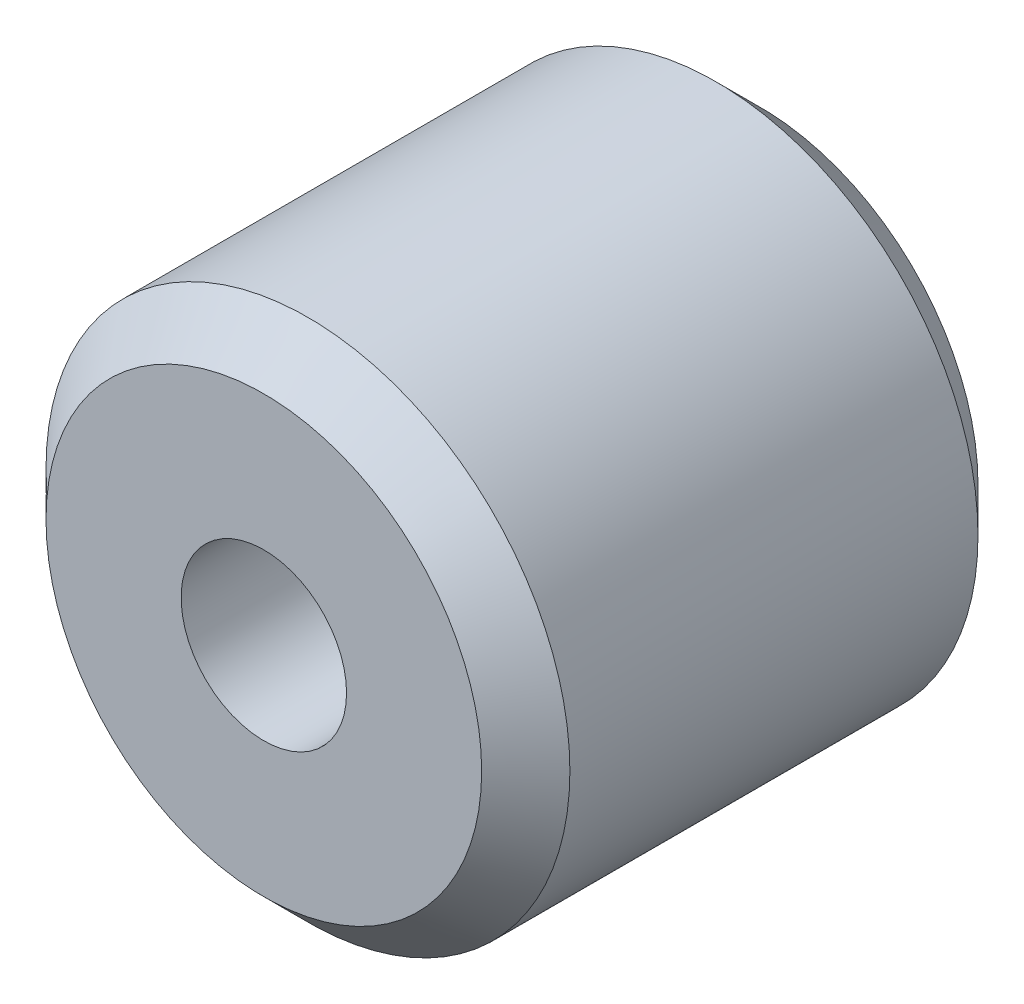
ISO-10303-21;
HEADER;
FILE_DESCRIPTION(('STEP AP214'),'2;1');
FILE_NAME('part.step','',(''),(''),'','','');
FILE_SCHEMA(('AUTOMOTIVE_DESIGN { 1 0 10303 214 1 1 1 1 }'));
ENDSEC;
DATA;
#1=APPLICATION_CONTEXT('core data for automotive mechanical design processes');
#2=APPLICATION_PROTOCOL_DEFINITION('international standard','automotive_design',2000,#1);
#3=PRODUCT_CONTEXT('',#1,'mechanical');
#4=PRODUCT('Part','Part','',(#3));
#5=PRODUCT_RELATED_PRODUCT_CATEGORY('part','',(#4));
#6=PRODUCT_DEFINITION_FORMATION('','',#4);
#7=PRODUCT_DEFINITION_CONTEXT('part definition',#1,'design');
#8=PRODUCT_DEFINITION('design','',#6,#7);
#9=PRODUCT_DEFINITION_SHAPE('','',#8);
#10=(LENGTH_UNIT() NAMED_UNIT(*) SI_UNIT(.MILLI.,.METRE.));
#11=(NAMED_UNIT(*) PLANE_ANGLE_UNIT() SI_UNIT($,.RADIAN.));
#12=(NAMED_UNIT(*) SI_UNIT($,.STERADIAN.) SOLID_ANGLE_UNIT());
#13=UNCERTAINTY_MEASURE_WITH_UNIT(LENGTH_MEASURE(1.E-05),#10,'distance_accuracy_value','');
#14=(GEOMETRIC_REPRESENTATION_CONTEXT(3) GLOBAL_UNCERTAINTY_ASSIGNED_CONTEXT((#13)) GLOBAL_UNIT_ASSIGNED_CONTEXT((#10,
#11,#12)) REPRESENTATION_CONTEXT('',''));
#15=CARTESIAN_POINT('',(0.,0.,0.));
#16=DIRECTION('',(0.,0.,1.));
#17=DIRECTION('',(1.,0.,0.));
#18=AXIS2_PLACEMENT_3D('',#15,#16,#17);
#19=CARTESIAN_POINT('',(0.,0.,9.));
#20=DIRECTION('',(0.,0.,1.));
#21=DIRECTION('',(1.,0.,0.));
#22=AXIS2_PLACEMENT_3D('',#19,#20,#21);
#23=PLANE('',#22);
#24=CARTESIAN_POINT('',(0.,0.,9.));
#25=DIRECTION('',(0.,0.,1.));
#26=DIRECTION('',(1.,0.,0.));
#27=AXIS2_PLACEMENT_3D('',#24,#25,#26);
#28=CIRCLE('',#27,3.95);
#29=CARTESIAN_POINT('',(3.95,0.,9.));
#30=VERTEX_POINT('',#29);
#31=EDGE_CURVE('E10',#30,#30,#28,.T.);
#32=ORIENTED_EDGE('',*,*,#31,.T.);
#33=EDGE_LOOP('',(#32));
#34=FACE_BOUND('',#33,.T.);
#35=CARTESIAN_POINT('',(0.,0.,9.));
#36=DIRECTION('',(0.,0.,1.));
#37=DIRECTION('',(1.,0.,0.));
#38=AXIS2_PLACEMENT_3D('',#35,#36,#37);
#39=CIRCLE('',#38,1.5);
#40=CARTESIAN_POINT('',(1.5,0.,9.));
#41=VERTEX_POINT('',#40);
#42=EDGE_CURVE('E58',#41,#41,#39,.T.);
#43=ORIENTED_EDGE('',*,*,#42,.F.);
#44=EDGE_LOOP('',(#43));
#45=FACE_BOUND('',#44,.T.);
#46=ADVANCED_FACE('F37',(#34,#45),#23,.T.);
#47=CARTESIAN_POINT('',(0.,0.,0.));
#48=DIRECTION('',(0.,0.,1.));
#49=DIRECTION('',(1.,0.,0.));
#50=AXIS2_PLACEMENT_3D('',#47,#48,#49);
#51=PLANE('',#50);
#52=CARTESIAN_POINT('',(0.,0.,0.));
#53=DIRECTION('',(0.,0.,1.));
#54=DIRECTION('',(1.,0.,0.));
#55=AXIS2_PLACEMENT_3D('',#52,#53,#54);
#56=CIRCLE('',#55,3.95);
#57=CARTESIAN_POINT('',(3.95,0.,0.));
#58=VERTEX_POINT('',#57);
#59=EDGE_CURVE('E45',#58,#58,#56,.F.);
#60=ORIENTED_EDGE('',*,*,#59,.T.);
#61=EDGE_LOOP('',(#60));
#62=FACE_BOUND('',#61,.T.);
#63=CARTESIAN_POINT('',(0.,0.,0.));
#64=DIRECTION('',(0.,0.,1.));
#65=DIRECTION('',(1.,0.,0.));
#66=AXIS2_PLACEMENT_3D('',#63,#64,#65);
#67=CIRCLE('',#66,1.5);
#68=CARTESIAN_POINT('',(1.5,0.,0.));
#69=VERTEX_POINT('',#68);
#70=EDGE_CURVE('E59',#69,#69,#67,.T.);
#71=ORIENTED_EDGE('',*,*,#70,.T.);
#72=EDGE_LOOP('',(#71));
#73=FACE_BOUND('',#72,.T.);
#74=ADVANCED_FACE('F69',(#62,#73),#51,.F.);
#75=CARTESIAN_POINT('',(0.,0.,9.));
#76=DIRECTION('',(0.,0.,-1.));
#77=DIRECTION('',(-1.,0.,0.));
#78=AXIS2_PLACEMENT_3D('',#75,#76,#77);
#79=CYLINDRICAL_SURFACE('',#78,4.75);
#80=CARTESIAN_POINT('',(0.,0.,0.8));
#81=DIRECTION('',(0.,0.,1.));
#82=DIRECTION('',(1.,0.,0.));
#83=AXIS2_PLACEMENT_3D('',#80,#81,#82);
#84=CIRCLE('',#83,4.75);
#85=CARTESIAN_POINT('',(4.75,0.,0.8));
#86=VERTEX_POINT('',#85);
#87=EDGE_CURVE('E49',#86,#86,#84,.T.);
#88=ORIENTED_EDGE('',*,*,#87,.T.);
#89=EDGE_LOOP('',(#88));
#90=FACE_BOUND('',#89,.T.);
#91=CARTESIAN_POINT('',(0.,0.,8.19999999999999));
#92=DIRECTION('',(0.,0.,1.));
#93=DIRECTION('',(1.,0.,0.));
#94=AXIS2_PLACEMENT_3D('',#91,#92,#93);
#95=CIRCLE('',#94,4.75);
#96=CARTESIAN_POINT('',(4.75,0.,8.19999999999999));
#97=VERTEX_POINT('',#96);
#98=EDGE_CURVE('E53',#97,#97,#95,.F.);
#99=ORIENTED_EDGE('',*,*,#98,.T.);
#100=EDGE_LOOP('',(#99));
#101=FACE_BOUND('',#100,.T.);
#102=ADVANCED_FACE('F74',(#90,#101),#79,.T.);
#103=CARTESIAN_POINT('',(0.,0.,9.));
#104=DIRECTION('',(0.,0.,-1.));
#105=DIRECTION('',(-1.,0.,0.));
#106=AXIS2_PLACEMENT_3D('',#103,#104,#105);
#107=CYLINDRICAL_SURFACE('',#106,1.5);
#108=ORIENTED_EDGE('',*,*,#42,.T.);
#109=EDGE_LOOP('',(#108));
#110=FACE_BOUND('',#109,.T.);
#111=ORIENTED_EDGE('',*,*,#70,.F.);
#112=EDGE_LOOP('',(#111));
#113=FACE_BOUND('',#112,.T.);
#114=ADVANCED_FACE('F65',(#110,#113),#107,.F.);
#115=CARTESIAN_POINT('',(0.,0.,0.8));
#116=DIRECTION('',(0.,0.,1.));
#117=DIRECTION('',(1.,0.,0.));
#118=AXIS2_PLACEMENT_3D('',#115,#116,#117);
#119=CONICAL_SURFACE('',#118,4.75,0.78539816339745);
#120=ORIENTED_EDGE('',*,*,#59,.F.);
#121=EDGE_LOOP('',(#120));
#122=FACE_BOUND('',#121,.T.);
#123=ORIENTED_EDGE('',*,*,#87,.F.);
#124=EDGE_LOOP('',(#123));
#125=FACE_BOUND('',#124,.T.);
#126=ADVANCED_FACE('F81',(#122,#125),#119,.T.);
#127=CARTESIAN_POINT('',(0.,0.,9.));
#128=DIRECTION('',(0.,0.,-1.));
#129=DIRECTION('',(-1.,0.,0.));
#130=AXIS2_PLACEMENT_3D('',#127,#128,#129);
#131=CONICAL_SURFACE('',#130,3.95,0.785398163397448);
#132=ORIENTED_EDGE('',*,*,#98,.F.);
#133=EDGE_LOOP('',(#132));
#134=FACE_BOUND('',#133,.T.);
#135=ORIENTED_EDGE('',*,*,#31,.F.);
#136=EDGE_LOOP('',(#135));
#137=FACE_BOUND('',#136,.T.);
#138=ADVANCED_FACE('F40',(#134,#137),#131,.T.);
#139=CLOSED_SHELL('',(#46,#74,#102,#114,#126,#138));
#140=MANIFOLD_SOLID_BREP('B2',#139);
#141=ADVANCED_BREP_SHAPE_REPRESENTATION('',(#18,#140),#14);
#142=SHAPE_DEFINITION_REPRESENTATION(#9,#141);
ENDSEC;
END-ISO-10303-21;
